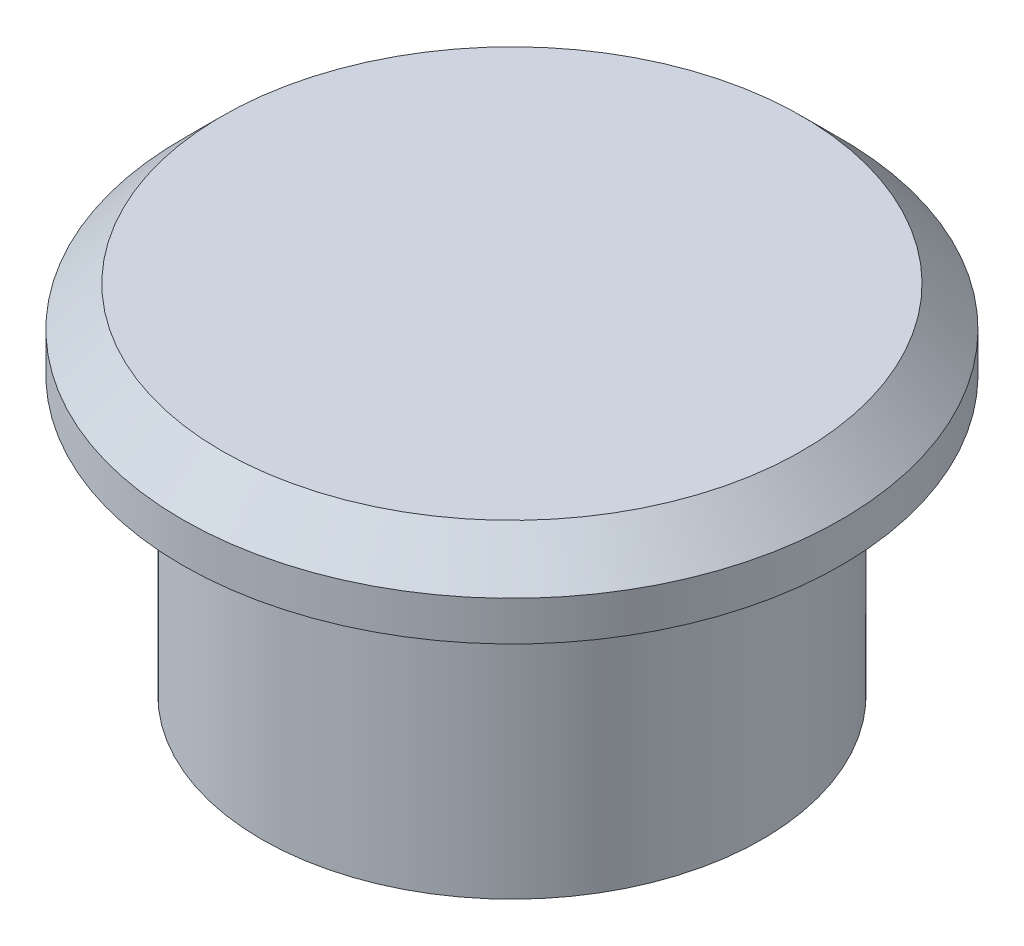
ISO-10303-21;
HEADER;
FILE_DESCRIPTION(('STEP AP214'),'2;1');
FILE_NAME('part.step','',(''),(''),'','','');
FILE_SCHEMA(('AUTOMOTIVE_DESIGN { 1 0 10303 214 1 1 1 1 }'));
ENDSEC;
DATA;
#1=APPLICATION_CONTEXT('core data for automotive mechanical design processes');
#2=APPLICATION_PROTOCOL_DEFINITION('international standard','automotive_design',2000,#1);
#3=PRODUCT_CONTEXT('',#1,'mechanical');
#4=PRODUCT('Part','Part','',(#3));
#5=PRODUCT_RELATED_PRODUCT_CATEGORY('part','',(#4));
#6=PRODUCT_DEFINITION_FORMATION('','',#4);
#7=PRODUCT_DEFINITION_CONTEXT('part definition',#1,'design');
#8=PRODUCT_DEFINITION('design','',#6,#7);
#9=PRODUCT_DEFINITION_SHAPE('','',#8);
#10=(LENGTH_UNIT() NAMED_UNIT(*) SI_UNIT(.MILLI.,.METRE.));
#11=(NAMED_UNIT(*) PLANE_ANGLE_UNIT() SI_UNIT($,.RADIAN.));
#12=(NAMED_UNIT(*) SI_UNIT($,.STERADIAN.) SOLID_ANGLE_UNIT());
#13=UNCERTAINTY_MEASURE_WITH_UNIT(LENGTH_MEASURE(1.E-05),#10,'distance_accuracy_value','');
#14=(GEOMETRIC_REPRESENTATION_CONTEXT(3) GLOBAL_UNCERTAINTY_ASSIGNED_CONTEXT((#13)) GLOBAL_UNIT_ASSIGNED_CONTEXT((#10,
#11,#12)) REPRESENTATION_CONTEXT('',''));
#15=CARTESIAN_POINT('',(0.,0.,0.));
#16=DIRECTION('',(0.,0.,1.));
#17=DIRECTION('',(1.,0.,0.));
#18=AXIS2_PLACEMENT_3D('',#15,#16,#17);
#19=CARTESIAN_POINT('',(0.,7.,0.));
#20=DIRECTION('',(0.,-1.,0.));
#21=DIRECTION('',(0.,0.,-1.));
#22=AXIS2_PLACEMENT_3D('',#19,#20,#21);
#23=CYLINDRICAL_SURFACE('',#22,6.33);
#24=CARTESIAN_POINT('',(0.,7.,0.));
#25=DIRECTION('',(0.,1.,0.));
#26=DIRECTION('',(0.,0.,1.));
#27=AXIS2_PLACEMENT_3D('',#24,#25,#26);
#28=CIRCLE('',#27,6.33);
#29=CARTESIAN_POINT('',(0.,7.,6.33));
#30=VERTEX_POINT('',#29);
#31=EDGE_CURVE('E42',#30,#30,#28,.T.);
#32=ORIENTED_EDGE('',*,*,#31,.F.);
#33=EDGE_LOOP('',(#32));
#34=FACE_BOUND('',#33,.T.);
#35=CARTESIAN_POINT('',(0.,0.,0.));
#36=DIRECTION('',(0.,1.,0.));
#37=DIRECTION('',(0.,0.,1.));
#38=AXIS2_PLACEMENT_3D('',#35,#36,#37);
#39=CIRCLE('',#38,6.33);
#40=CARTESIAN_POINT('',(0.,0.,6.33));
#41=VERTEX_POINT('',#40);
#42=EDGE_CURVE('E46',#41,#41,#39,.T.);
#43=ORIENTED_EDGE('',*,*,#42,.T.);
#44=EDGE_LOOP('',(#43));
#45=FACE_BOUND('',#44,.T.);
#46=ADVANCED_FACE('F31',(#34,#45),#23,.T.);
#47=CARTESIAN_POINT('',(0.,0.,0.));
#48=DIRECTION('',(0.,1.,0.));
#49=DIRECTION('',(0.,0.,1.));
#50=AXIS2_PLACEMENT_3D('',#47,#48,#49);
#51=PLANE('',#50);
#52=CARTESIAN_POINT('',(0.,0.,0.));
#53=DIRECTION('',(0.,1.,0.));
#54=DIRECTION('',(0.,0.,1.));
#55=AXIS2_PLACEMENT_3D('',#52,#53,#54);
#56=CIRCLE('',#55,4.69171269815438);
#57=CARTESIAN_POINT('',(0.,0.,4.69171269815438));
#58=VERTEX_POINT('',#57);
#59=EDGE_CURVE('E50',#58,#58,#56,.T.);
#60=ORIENTED_EDGE('',*,*,#59,.T.);
#61=EDGE_LOOP('',(#60));
#62=FACE_BOUND('',#61,.T.);
#63=ORIENTED_EDGE('',*,*,#42,.F.);
#64=EDGE_LOOP('',(#63));
#65=FACE_BOUND('',#64,.T.);
#66=ADVANCED_FACE('F72',(#62,#65),#51,.F.);
#67=CARTESIAN_POINT('',(0.,0.,0.));
#68=DIRECTION('',(0.,1.,0.));
#69=DIRECTION('',(0.,0.,1.));
#70=AXIS2_PLACEMENT_3D('',#67,#68,#69);
#71=CYLINDRICAL_SURFACE('',#70,4.69171269815438);
#72=ORIENTED_EDGE('',*,*,#59,.F.);
#73=EDGE_LOOP('',(#72));
#74=FACE_BOUND('',#73,.T.);
#75=CARTESIAN_POINT('',(0.,7.,0.));
#76=DIRECTION('',(0.,1.,0.));
#77=DIRECTION('',(0.,0.,1.));
#78=AXIS2_PLACEMENT_3D('',#75,#76,#77);
#79=CIRCLE('',#78,4.69171269815438);
#80=CARTESIAN_POINT('',(0.,7.,4.69171269815438));
#81=VERTEX_POINT('',#80);
#82=EDGE_CURVE('E54',#81,#81,#79,.F.);
#83=ORIENTED_EDGE('',*,*,#82,.F.);
#84=EDGE_LOOP('',(#83));
#85=FACE_BOUND('',#84,.T.);
#86=ADVANCED_FACE('F76',(#74,#85),#71,.F.);
#87=CARTESIAN_POINT('',(0.,7.,0.));
#88=DIRECTION('',(0.,1.,0.));
#89=DIRECTION('',(0.,0.,1.));
#90=AXIS2_PLACEMENT_3D('',#87,#88,#89);
#91=PLANE('',#90);
#92=ORIENTED_EDGE('',*,*,#82,.T.);
#93=EDGE_LOOP('',(#92));
#94=FACE_BOUND('',#93,.T.);
#95=ADVANCED_FACE('F66',(#94),#91,.F.);
#96=CARTESIAN_POINT('',(0.,7.,0.));
#97=DIRECTION('',(0.,1.,0.));
#98=DIRECTION('',(0.,0.,1.));
#99=AXIS2_PLACEMENT_3D('',#96,#97,#98);
#100=CIRCLE('',#99,8.33);
#101=CARTESIAN_POINT('',(0.,7.,8.33));
#102=VERTEX_POINT('',#101);
#103=EDGE_CURVE('E57',#102,#102,#100,.T.);
#104=ORIENTED_EDGE('',*,*,#103,.F.);
#105=EDGE_LOOP('',(#104));
#106=FACE_BOUND('',#105,.T.);
#107=ORIENTED_EDGE('',*,*,#31,.T.);
#108=EDGE_LOOP('',(#107));
#109=FACE_BOUND('',#108,.T.);
#110=ADVANCED_FACE('F63',(#106,#109),#91,.F.);
#111=CARTESIAN_POINT('',(0.,9.,0.));
#112=DIRECTION('',(0.,-1.,0.));
#113=DIRECTION('',(0.,0.,-1.));
#114=AXIS2_PLACEMENT_3D('',#111,#112,#113);
#115=CYLINDRICAL_SURFACE('',#114,8.33);
#116=CARTESIAN_POINT('',(0.,8.,0.));
#117=DIRECTION('',(0.,1.,0.));
#118=DIRECTION('',(0.,0.,1.));
#119=AXIS2_PLACEMENT_3D('',#116,#117,#118);
#120=CIRCLE('',#119,8.33);
#121=CARTESIAN_POINT('',(0.,8.,8.33));
#122=VERTEX_POINT('',#121);
#123=EDGE_CURVE('E10',#122,#122,#120,.F.);
#124=ORIENTED_EDGE('',*,*,#123,.T.);
#125=EDGE_LOOP('',(#124));
#126=FACE_BOUND('',#125,.T.);
#127=ORIENTED_EDGE('',*,*,#103,.T.);
#128=EDGE_LOOP('',(#127));
#129=FACE_BOUND('',#128,.T.);
#130=ADVANCED_FACE('F61',(#126,#129),#115,.T.);
#131=CARTESIAN_POINT('',(0.,9.,0.));
#132=DIRECTION('',(0.,1.,0.));
#133=DIRECTION('',(0.,0.,1.));
#134=AXIS2_PLACEMENT_3D('',#131,#132,#133);
#135=PLANE('',#134);
#136=CARTESIAN_POINT('',(0.,9.,0.));
#137=DIRECTION('',(0.,1.,0.));
#138=DIRECTION('',(0.,0.,1.));
#139=AXIS2_PLACEMENT_3D('',#136,#137,#138);
#140=CIRCLE('',#139,7.33);
#141=CARTESIAN_POINT('',(0.,9.,7.33));
#142=VERTEX_POINT('',#141);
#143=EDGE_CURVE('E38',#142,#142,#140,.T.);
#144=ORIENTED_EDGE('',*,*,#143,.T.);
#145=EDGE_LOOP('',(#144));
#146=FACE_BOUND('',#145,.T.);
#147=ADVANCED_FACE('F86',(#146),#135,.T.);
#148=CARTESIAN_POINT('',(0.,9.,0.));
#149=DIRECTION('',(0.,-1.,0.));
#150=DIRECTION('',(0.,0.,-1.));
#151=AXIS2_PLACEMENT_3D('',#148,#149,#150);
#152=CONICAL_SURFACE('',#151,7.33,0.785398163397448);
#153=ORIENTED_EDGE('',*,*,#123,.F.);
#154=EDGE_LOOP('',(#153));
#155=FACE_BOUND('',#154,.T.);
#156=ORIENTED_EDGE('',*,*,#143,.F.);
#157=EDGE_LOOP('',(#156));
#158=FACE_BOUND('',#157,.T.);
#159=ADVANCED_FACE('F33',(#155,#158),#152,.T.);
#160=CLOSED_SHELL('',(#46,#66,#86,#95,#110,#130,#147,#159));
#161=MANIFOLD_SOLID_BREP('B2',#160);
#162=ADVANCED_BREP_SHAPE_REPRESENTATION('',(#18,#161),#14);
#163=SHAPE_DEFINITION_REPRESENTATION(#9,#162);
ENDSEC;
END-ISO-10303-21;
